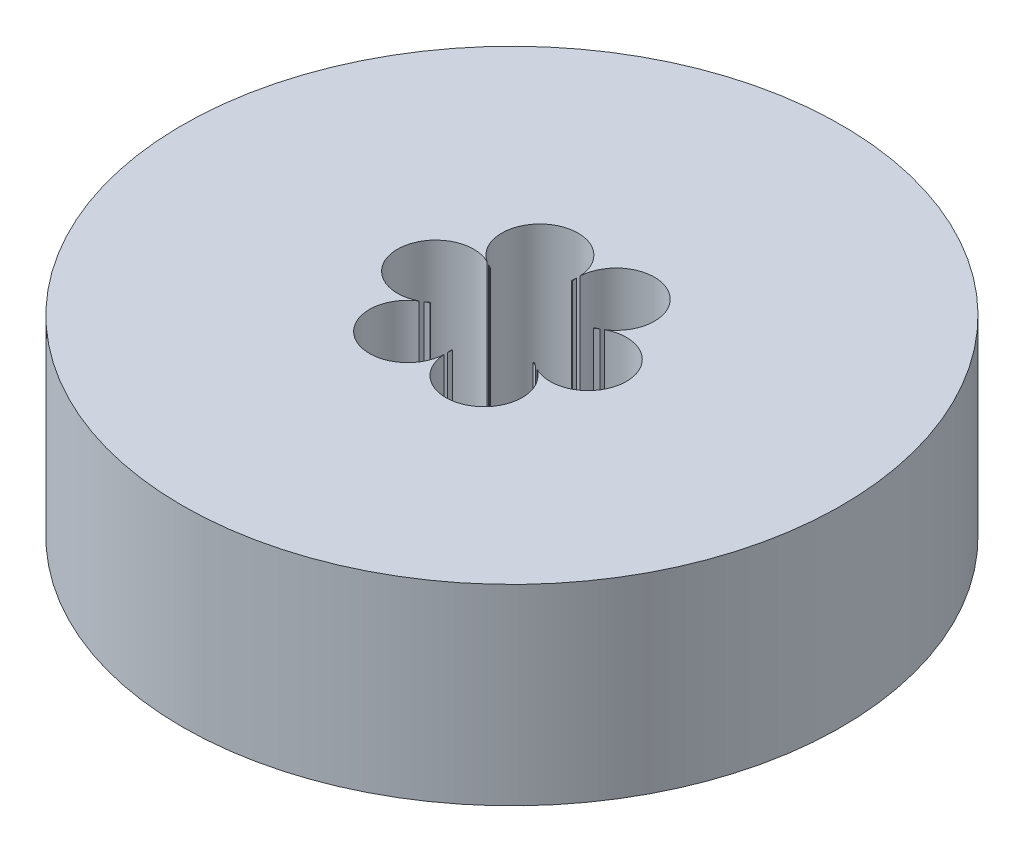
ISO-10303-21;
HEADER;
FILE_DESCRIPTION(('STEP AP214'),'2;1');
FILE_NAME('part.step','',(''),(''),'','','');
FILE_SCHEMA(('AUTOMOTIVE_DESIGN { 1 0 10303 214 1 1 1 1 }'));
ENDSEC;
DATA;
#1=APPLICATION_CONTEXT('core data for automotive mechanical design processes');
#2=APPLICATION_PROTOCOL_DEFINITION('international standard','automotive_design',2000,#1);
#3=PRODUCT_CONTEXT('',#1,'mechanical');
#4=PRODUCT('Part','Part','',(#3));
#5=PRODUCT_RELATED_PRODUCT_CATEGORY('part','',(#4));
#6=PRODUCT_DEFINITION_FORMATION('','',#4);
#7=PRODUCT_DEFINITION_CONTEXT('part definition',#1,'design');
#8=PRODUCT_DEFINITION('design','',#6,#7);
#9=PRODUCT_DEFINITION_SHAPE('','',#8);
#10=(LENGTH_UNIT() NAMED_UNIT(*) SI_UNIT(.MILLI.,.METRE.));
#11=(NAMED_UNIT(*) PLANE_ANGLE_UNIT() SI_UNIT($,.RADIAN.));
#12=(NAMED_UNIT(*) SI_UNIT($,.STERADIAN.) SOLID_ANGLE_UNIT());
#13=UNCERTAINTY_MEASURE_WITH_UNIT(LENGTH_MEASURE(1.E-05),#10,'distance_accuracy_value','');
#14=(GEOMETRIC_REPRESENTATION_CONTEXT(3) GLOBAL_UNCERTAINTY_ASSIGNED_CONTEXT((#13)) GLOBAL_UNIT_ASSIGNED_CONTEXT((#10,
#11,#12)) REPRESENTATION_CONTEXT('',''));
#15=CARTESIAN_POINT('',(0.,0.,0.));
#16=DIRECTION('',(0.,0.,1.));
#17=DIRECTION('',(1.,0.,0.));
#18=AXIS2_PLACEMENT_3D('',#15,#16,#17);
#19=CARTESIAN_POINT('',(0.,16.,0.));
#20=DIRECTION('',(0.,1.,0.));
#21=DIRECTION('',(0.,0.,1.));
#22=AXIS2_PLACEMENT_3D('',#19,#20,#21);
#23=PLANE('',#22);
#24=CARTESIAN_POINT('',(-3.18521548853427,16.,5.51695505919671));
#25=DIRECTION('',(0.,1.,0.));
#26=DIRECTION('',(0.86602540378444,0.,0.499999999999998));
#27=AXIS2_PLACEMENT_3D('',#24,#25,#26);
#28=CIRCLE('',#27,3.18857524727251);
#29=CARTESIAN_POINT('',(-4.31057112125339,16.,2.53356993363442));
#30=VERTEX_POINT('',#29);
#31=CARTESIAN_POINT('',(-4.65109202377948,16.,2.68530923195481));
#32=VERTEX_POINT('',#31);
#33=EDGE_CURVE('E298',#30,#32,#28,.T.);
#34=ORIENTED_EDGE('',*,*,#33,.F.);
#35=CARTESIAN_POINT('',(0.,16.,0.));
#36=DIRECTION('',(0.,1.,0.));
#37=DIRECTION('',(0.,0.,1.));
#38=AXIS2_PLACEMENT_3D('',#35,#36,#37);
#39=CIRCLE('',#38,5.);
#40=CARTESIAN_POINT('',(-4.34942148541855,16.,2.4662791290078));
#41=VERTEX_POINT('',#40);
#42=EDGE_CURVE('E329',#41,#30,#39,.T.);
#43=ORIENTED_EDGE('',*,*,#42,.F.);
#44=CARTESIAN_POINT('',(-6.37043097706857,16.,0.));
#45=DIRECTION('',(0.,1.,0.));
#46=DIRECTION('',(0.,0.,1.));
#47=AXIS2_PLACEMENT_3D('',#44,#45,#46);
#48=CIRCLE('',#47,3.18857524727251);
#49=EDGE_CURVE('E328',#32,#41,#48,.T.);
#50=ORIENTED_EDGE('',*,*,#49,.F.);
#51=EDGE_LOOP('',(#34,#43,#50));
#52=FACE_BOUND('',#51,.T.);
#53=ADVANCED_FACE('F39',(#52),#23,.T.);
#54=CARTESIAN_POINT('',(-3.18521548853435,16.,-5.51695505919666));
#55=DIRECTION('',(0.,1.,0.));
#56=DIRECTION('',(-0.866025403784433,0.,0.50000000000001));
#57=AXIS2_PLACEMENT_3D('',#54,#55,#56);
#58=CIRCLE('',#57,3.18857524727251);
#59=CARTESIAN_POINT('',(-4.65109202377879,16.,-2.68530923195437));
#60=VERTEX_POINT('',#59);
#61=CARTESIAN_POINT('',(-4.31057112125342,16.,-2.53356993363436));
#62=VERTEX_POINT('',#61);
#63=EDGE_CURVE('E233',#60,#62,#58,.T.);
#64=ORIENTED_EDGE('',*,*,#63,.F.);
#65=CARTESIAN_POINT('',(-4.34942148541855,16.,-2.4662791290078));
#66=VERTEX_POINT('',#65);
#67=EDGE_CURVE('E324',#66,#60,#48,.T.);
#68=ORIENTED_EDGE('',*,*,#67,.F.);
#69=EDGE_CURVE('E333',#62,#66,#39,.T.);
#70=ORIENTED_EDGE('',*,*,#69,.F.);
#71=EDGE_LOOP('',(#64,#68,#70));
#72=FACE_BOUND('',#71,.T.);
#73=ADVANCED_FACE('F439',(#72),#23,.T.);
#74=CARTESIAN_POINT('',(3.18521548853423,16.,-5.51695505919673));
#75=DIRECTION('',(0.,1.,0.));
#76=DIRECTION('',(-0.866025403784443,0.,-0.499999999999992));
#77=AXIS2_PLACEMENT_3D('',#74,#75,#76);
#78=CIRCLE('',#77,3.18857524727251);
#79=CARTESIAN_POINT('',(4.31057112125337,16.,-2.53356993363445));
#80=VERTEX_POINT('',#79);
#81=CARTESIAN_POINT('',(4.65109202377982,16.,-2.68530923195503));
#82=VERTEX_POINT('',#81);
#83=EDGE_CURVE('E251',#80,#82,#78,.T.);
#84=ORIENTED_EDGE('',*,*,#83,.F.);
#85=CARTESIAN_POINT('',(4.34942148541855,16.,-2.4662791290078));
#86=VERTEX_POINT('',#85);
#87=EDGE_CURVE('E392',#86,#80,#39,.T.);
#88=ORIENTED_EDGE('',*,*,#87,.F.);
#89=CARTESIAN_POINT('',(6.37043097706857,16.,0.));
#90=DIRECTION('',(0.,1.,0.));
#91=DIRECTION('',(0.,0.,-1.));
#92=AXIS2_PLACEMENT_3D('',#89,#90,#91);
#93=CIRCLE('',#92,3.18857524727251);
#94=EDGE_CURVE('E263',#82,#86,#93,.T.);
#95=ORIENTED_EDGE('',*,*,#94,.F.);
#96=EDGE_LOOP('',(#84,#88,#95));
#97=FACE_BOUND('',#96,.T.);
#98=ADVANCED_FACE('F450',(#97),#23,.T.);
#99=CARTESIAN_POINT('',(4.34942148541855,16.,2.4662791290078));
#100=VERTEX_POINT('',#99);
#101=CARTESIAN_POINT('',(4.65109202377915,16.,2.6853092319546));
#102=VERTEX_POINT('',#101);
#103=EDGE_CURVE('E262',#100,#102,#93,.T.);
#104=ORIENTED_EDGE('',*,*,#103,.F.);
#105=CARTESIAN_POINT('',(4.3105711212534,16.,2.53356993363439));
#106=VERTEX_POINT('',#105);
#107=EDGE_CURVE('E394',#106,#100,#39,.T.);
#108=ORIENTED_EDGE('',*,*,#107,.F.);
#109=CARTESIAN_POINT('',(3.18521548853431,16.,5.51695505919669));
#110=DIRECTION('',(0.,1.,0.));
#111=DIRECTION('',(0.866025403784436,0.,-0.500000000000004));
#112=AXIS2_PLACEMENT_3D('',#109,#110,#111);
#113=CIRCLE('',#112,3.18857524727251);
#114=EDGE_CURVE('E280',#102,#106,#113,.T.);
#115=ORIENTED_EDGE('',*,*,#114,.F.);
#116=EDGE_LOOP('',(#104,#108,#115));
#117=FACE_BOUND('',#116,.T.);
#118=ADVANCED_FACE('F470',(#117),#23,.T.);
#119=CARTESIAN_POINT('',(0.0388503641651819,16.,4.99984906264222));
#120=VERTEX_POINT('',#119);
#121=CARTESIAN_POINT('',(0.,16.,5.37061846390962));
#122=VERTEX_POINT('',#121);
#123=EDGE_CURVE('E276',#120,#122,#113,.T.);
#124=ORIENTED_EDGE('',*,*,#123,.F.);
#125=CARTESIAN_POINT('',(-0.0388503641651468,16.,4.99984906264222));
#126=VERTEX_POINT('',#125);
#127=EDGE_CURVE('E331',#126,#120,#39,.T.);
#128=ORIENTED_EDGE('',*,*,#127,.F.);
#129=EDGE_CURVE('E300',#122,#126,#28,.T.);
#130=ORIENTED_EDGE('',*,*,#129,.F.);
#131=EDGE_LOOP('',(#124,#128,#130));
#132=FACE_BOUND('',#131,.T.);
#133=ADVANCED_FACE('F405',(#132),#23,.T.);
#134=CARTESIAN_POINT('',(0.,16.,-5.37061846390962));
#135=VERTEX_POINT('',#134);
#136=CARTESIAN_POINT('',(0.0388503641651117,16.,-4.99984906264222));
#137=VERTEX_POINT('',#136);
#138=EDGE_CURVE('E215',#135,#137,#78,.T.);
#139=ORIENTED_EDGE('',*,*,#138,.F.);
#140=CARTESIAN_POINT('',(-0.0388503641652158,16.,-4.99984906264222));
#141=VERTEX_POINT('',#140);
#142=EDGE_CURVE('E234',#141,#135,#58,.T.);
#143=ORIENTED_EDGE('',*,*,#142,.F.);
#144=EDGE_CURVE('E252',#137,#141,#39,.T.);
#145=ORIENTED_EDGE('',*,*,#144,.F.);
#146=EDGE_LOOP('',(#139,#143,#145));
#147=FACE_BOUND('',#146,.T.);
#148=ADVANCED_FACE('F253',(#147),#23,.T.);
#149=CARTESIAN_POINT('',(-6.37043097706857,0.724362100448394,0.));
#150=DIRECTION('',(0.,1.,0.));
#151=DIRECTION('',(0.,0.,1.));
#152=AXIS2_PLACEMENT_3D('',#149,#150,#151);
#153=CYLINDRICAL_SURFACE('',#152,3.18857524727251);
#154=CARTESIAN_POINT('',(-6.37043097706857,0.724362100448394,0.));
#155=DIRECTION('',(0.,1.,0.));
#156=DIRECTION('',(0.,0.,1.));
#157=AXIS2_PLACEMENT_3D('',#154,#155,#156);
#158=CIRCLE('',#157,3.18857524727251);
#159=CARTESIAN_POINT('',(-4.65109202377948,0.724362100448394,2.68530923195481));
#160=VERTEX_POINT('',#159);
#161=CARTESIAN_POINT('',(-4.34942148541855,0.724362100448394,2.4662791290078));
#162=VERTEX_POINT('',#161);
#163=EDGE_CURVE('E65',#160,#162,#158,.T.);
#164=ORIENTED_EDGE('',*,*,#163,.F.);
#165=DIRECTION('',(0.,1.,0.));
#166=VECTOR('',#165,1.);
#167=CARTESIAN_POINT('',(-4.65109202377948,8.3621810502242,2.68530923195481));
#168=LINE('',#167,#166);
#169=EDGE_CURVE('E306',#160,#32,#168,.T.);
#170=ORIENTED_EDGE('',*,*,#169,.T.);
#171=ORIENTED_EDGE('',*,*,#49,.T.);
#172=DIRECTION('',(0.,1.,0.));
#173=VECTOR('',#172,1.);
#174=CARTESIAN_POINT('',(-4.34942148541855,8.3621810502242,2.4662791290078));
#175=LINE('',#174,#173);
#176=EDGE_CURVE('E347',#41,#162,#175,.F.);
#177=ORIENTED_EDGE('',*,*,#176,.T.);
#178=EDGE_LOOP('',(#164,#170,#171,#177));
#179=FACE_BOUND('',#178,.T.);
#180=ADVANCED_FACE('F458',(#179),#153,.F.);
#181=CARTESIAN_POINT('',(-4.90455444182412,16.,-2.83164582724229));
#182=VERTEX_POINT('',#181);
#183=CARTESIAN_POINT('',(-4.90455444182336,16.,2.8316458272419));
#184=VERTEX_POINT('',#183);
#185=EDGE_CURVE('E327',#182,#184,#48,.T.);
#186=ORIENTED_EDGE('',*,*,#185,.T.);
#187=DIRECTION('',(0.,1.,0.));
#188=VECTOR('',#187,1.);
#189=CARTESIAN_POINT('',(-4.90455444182336,8.3621810502242,2.8316458272419));
#190=LINE('',#189,#188);
#191=CARTESIAN_POINT('',(-4.90455444182336,0.724362100448394,2.8316458272419));
#192=VERTEX_POINT('',#191);
#193=EDGE_CURVE('E304',#184,#192,#190,.F.);
#194=ORIENTED_EDGE('',*,*,#193,.T.);
#195=CARTESIAN_POINT('',(-4.90455444182412,0.724362100448394,-2.83164582724229));
#196=VERTEX_POINT('',#195);
#197=EDGE_CURVE('E322',#196,#192,#158,.T.);
#198=ORIENTED_EDGE('',*,*,#197,.F.);
#199=DIRECTION('',(0.,1.,0.));
#200=VECTOR('',#199,1.);
#201=CARTESIAN_POINT('',(-4.90455444182412,8.3621810502242,-2.83164582724229));
#202=LINE('',#201,#200);
#203=EDGE_CURVE('E226',#196,#182,#202,.T.);
#204=ORIENTED_EDGE('',*,*,#203,.T.);
#205=EDGE_LOOP('',(#186,#194,#198,#204));
#206=FACE_BOUND('',#205,.T.);
#207=ADVANCED_FACE('F423',(#206),#153,.F.);
#208=CARTESIAN_POINT('',(0.,16.,0.));
#209=DIRECTION('',(0.,-1.,0.));
#210=DIRECTION('',(0.,0.,-1.));
#211=AXIS2_PLACEMENT_3D('',#208,#209,#210);
#212=CYLINDRICAL_SURFACE('',#211,27.5);
#213=CARTESIAN_POINT('',(0.,16.,0.));
#214=DIRECTION('',(0.,1.,0.));
#215=DIRECTION('',(0.,0.,1.));
#216=AXIS2_PLACEMENT_3D('',#213,#214,#215);
#217=CIRCLE('',#216,27.5);
#218=CARTESIAN_POINT('',(0.,16.,27.5));
#219=VERTEX_POINT('',#218);
#220=EDGE_CURVE('E337',#219,#219,#217,.T.);
#221=ORIENTED_EDGE('',*,*,#220,.F.);
#222=EDGE_LOOP('',(#221));
#223=FACE_BOUND('',#222,.T.);
#224=CARTESIAN_POINT('',(0.,0.,0.));
#225=DIRECTION('',(0.,1.,0.));
#226=DIRECTION('',(0.,0.,1.));
#227=AXIS2_PLACEMENT_3D('',#224,#225,#226);
#228=CIRCLE('',#227,27.5);
#229=CARTESIAN_POINT('',(0.,0.,27.5));
#230=VERTEX_POINT('',#229);
#231=EDGE_CURVE('E334',#230,#230,#228,.T.);
#232=ORIENTED_EDGE('',*,*,#231,.T.);
#233=EDGE_LOOP('',(#232));
#234=FACE_BOUND('',#233,.T.);
#235=ADVANCED_FACE('F41',(#223,#234),#212,.T.);
#236=CARTESIAN_POINT('',(0.,16.,5.66329165448378));
#237=VERTEX_POINT('',#236);
#238=EDGE_CURVE('E289',#184,#237,#28,.T.);
#239=ORIENTED_EDGE('',*,*,#238,.F.);
#240=ORIENTED_EDGE('',*,*,#185,.F.);
#241=CARTESIAN_POINT('',(0.,16.,-5.66329165448378));
#242=VERTEX_POINT('',#241);
#243=EDGE_CURVE('E229',#242,#182,#58,.T.);
#244=ORIENTED_EDGE('',*,*,#243,.F.);
#245=CARTESIAN_POINT('',(4.90455444182298,16.,-2.8316458272417));
#246=VERTEX_POINT('',#245);
#247=EDGE_CURVE('E218',#246,#242,#78,.T.);
#248=ORIENTED_EDGE('',*,*,#247,.F.);
#249=CARTESIAN_POINT('',(4.90455444182372,16.,2.83164582724209));
#250=VERTEX_POINT('',#249);
#251=EDGE_CURVE('E257',#250,#246,#93,.T.);
#252=ORIENTED_EDGE('',*,*,#251,.F.);
#253=EDGE_CURVE('E269',#237,#250,#113,.T.);
#254=ORIENTED_EDGE('',*,*,#253,.F.);
#255=EDGE_LOOP('',(#239,#240,#244,#248,#252,#254));
#256=FACE_BOUND('',#255,.T.);
#257=ORIENTED_EDGE('',*,*,#220,.T.);
#258=EDGE_LOOP('',(#257));
#259=FACE_BOUND('',#258,.T.);
#260=ADVANCED_FACE('F418',(#256,#259),#23,.T.);
#261=CARTESIAN_POINT('',(0.,0.,0.));
#262=DIRECTION('',(0.,1.,0.));
#263=DIRECTION('',(0.,0.,1.));
#264=AXIS2_PLACEMENT_3D('',#261,#262,#263);
#265=PLANE('',#264);
#266=CARTESIAN_POINT('',(0.,0.,0.));
#267=DIRECTION('',(0.,1.,0.));
#268=DIRECTION('',(0.,0.,1.));
#269=AXIS2_PLACEMENT_3D('',#266,#267,#268);
#270=CIRCLE('',#269,5.);
#271=CARTESIAN_POINT('',(0.,0.,5.));
#272=VERTEX_POINT('',#271);
#273=EDGE_CURVE('E323',#272,#272,#270,.T.);
#274=ORIENTED_EDGE('',*,*,#273,.T.);
#275=EDGE_LOOP('',(#274));
#276=FACE_BOUND('',#275,.T.);
#277=ORIENTED_EDGE('',*,*,#231,.F.);
#278=EDGE_LOOP('',(#277));
#279=FACE_BOUND('',#278,.T.);
#280=ADVANCED_FACE('F451',(#276,#279),#265,.F.);
#281=CARTESIAN_POINT('',(0.,16.,0.));
#282=DIRECTION('',(0.,-1.,0.));
#283=DIRECTION('',(0.,0.,-1.));
#284=AXIS2_PLACEMENT_3D('',#281,#282,#283);
#285=CYLINDRICAL_SURFACE('',#284,5.);
#286=DIRECTION('',(0.,1.,0.));
#287=VECTOR('',#286,1.);
#288=CARTESIAN_POINT('',(-4.31057112125339,8.3621810502242,2.53356993363442));
#289=LINE('',#288,#287);
#290=CARTESIAN_POINT('',(-4.31057112125339,0.724362100448394,2.53356993363442));
#291=VERTEX_POINT('',#290);
#292=EDGE_CURVE('E311',#291,#30,#289,.T.);
#293=ORIENTED_EDGE('',*,*,#292,.F.);
#294=CARTESIAN_POINT('',(0.,0.724362100448394,0.));
#295=DIRECTION('',(0.,1.,0.));
#296=DIRECTION('',(0.,0.,1.));
#297=AXIS2_PLACEMENT_3D('',#294,#295,#296);
#298=CIRCLE('',#297,5.);
#299=CARTESIAN_POINT('',(-0.0388503641651468,0.724362100448394,4.99984906264222));
#300=VERTEX_POINT('',#299);
#301=EDGE_CURVE('E312',#291,#300,#298,.T.);
#302=ORIENTED_EDGE('',*,*,#301,.T.);
#303=DIRECTION('',(0.,1.,0.));
#304=VECTOR('',#303,1.);
#305=CARTESIAN_POINT('',(-0.0388503641651464,8.3621810502242,4.99984906264222));
#306=LINE('',#305,#304);
#307=EDGE_CURVE('E313',#126,#300,#306,.F.);
#308=ORIENTED_EDGE('',*,*,#307,.F.);
#309=ORIENTED_EDGE('',*,*,#127,.T.);
#310=DIRECTION('',(0.,1.,0.));
#311=VECTOR('',#310,1.);
#312=CARTESIAN_POINT('',(0.0388503641651815,8.3621810502242,4.99984906264222));
#313=LINE('',#312,#311);
#314=CARTESIAN_POINT('',(0.0388503641651819,0.724362100448394,4.99984906264222));
#315=VERTEX_POINT('',#314);
#316=EDGE_CURVE('E11',#315,#120,#313,.T.);
#317=ORIENTED_EDGE('',*,*,#316,.F.);
#318=CARTESIAN_POINT('',(4.3105711212534,0.724362100448394,2.53356993363439));
#319=VERTEX_POINT('',#318);
#320=EDGE_CURVE('E317',#315,#319,#298,.T.);
#321=ORIENTED_EDGE('',*,*,#320,.T.);
#322=DIRECTION('',(0.,1.,0.));
#323=VECTOR('',#322,1.);
#324=CARTESIAN_POINT('',(4.3105711212534,8.3621810502242,2.53356993363439));
#325=LINE('',#324,#323);
#326=EDGE_CURVE('E50',#106,#319,#325,.F.);
#327=ORIENTED_EDGE('',*,*,#326,.F.);
#328=ORIENTED_EDGE('',*,*,#107,.T.);
#329=DIRECTION('',(0.,1.,0.));
#330=VECTOR('',#329,1.);
#331=CARTESIAN_POINT('',(4.34942148541855,8.3621810502242,2.4662791290078));
#332=LINE('',#331,#330);
#333=CARTESIAN_POINT('',(4.34942148541855,0.724362100448394,2.4662791290078));
#334=VERTEX_POINT('',#333);
#335=EDGE_CURVE('E360',#334,#100,#332,.T.);
#336=ORIENTED_EDGE('',*,*,#335,.F.);
#337=CARTESIAN_POINT('',(4.34942148541855,0.724362100448394,-2.4662791290078));
#338=VERTEX_POINT('',#337);
#339=EDGE_CURVE('E374',#334,#338,#298,.T.);
#340=ORIENTED_EDGE('',*,*,#339,.T.);
#341=DIRECTION('',(0.,1.,0.));
#342=VECTOR('',#341,1.);
#343=CARTESIAN_POINT('',(4.34942148541855,8.3621810502242,-2.4662791290078));
#344=LINE('',#343,#342);
#345=EDGE_CURVE('E354',#86,#338,#344,.F.);
#346=ORIENTED_EDGE('',*,*,#345,.F.);
#347=ORIENTED_EDGE('',*,*,#87,.T.);
#348=DIRECTION('',(0.,1.,0.));
#349=VECTOR('',#348,1.);
#350=CARTESIAN_POINT('',(4.31057112125337,8.3621810502242,-2.53356993363445));
#351=LINE('',#350,#349);
#352=CARTESIAN_POINT('',(4.31057112125337,0.724362100448394,-2.53356993363445));
#353=VERTEX_POINT('',#352);
#354=EDGE_CURVE('E352',#353,#80,#351,.T.);
#355=ORIENTED_EDGE('',*,*,#354,.F.);
#356=CARTESIAN_POINT('',(0.0388503641651117,0.724362100448394,-4.99984906264222));
#357=VERTEX_POINT('',#356);
#358=EDGE_CURVE('E380',#353,#357,#298,.T.);
#359=ORIENTED_EDGE('',*,*,#358,.T.);
#360=DIRECTION('',(0.,1.,0.));
#361=VECTOR('',#360,1.);
#362=CARTESIAN_POINT('',(0.0388503641651113,8.3621810502242,-4.99984906264222));
#363=LINE('',#362,#361);
#364=EDGE_CURVE('E351',#137,#357,#363,.F.);
#365=ORIENTED_EDGE('',*,*,#364,.F.);
#366=ORIENTED_EDGE('',*,*,#144,.T.);
#367=DIRECTION('',(0.,1.,0.));
#368=VECTOR('',#367,1.);
#369=CARTESIAN_POINT('',(-0.0388503641652162,8.3621810502242,-4.99984906264222));
#370=LINE('',#369,#368);
#371=CARTESIAN_POINT('',(-0.0388503641652158,0.724362100448394,-4.99984906264222));
#372=VERTEX_POINT('',#371);
#373=EDGE_CURVE('E245',#372,#141,#370,.T.);
#374=ORIENTED_EDGE('',*,*,#373,.F.);
#375=CARTESIAN_POINT('',(-4.31057112125342,0.724362100448394,-2.53356993363436));
#376=VERTEX_POINT('',#375);
#377=EDGE_CURVE('E318',#372,#376,#298,.T.);
#378=ORIENTED_EDGE('',*,*,#377,.T.);
#379=DIRECTION('',(0.,1.,0.));
#380=VECTOR('',#379,1.);
#381=CARTESIAN_POINT('',(-4.31057112125342,8.3621810502242,-2.53356993363436));
#382=LINE('',#381,#380);
#383=EDGE_CURVE('E305',#62,#376,#382,.F.);
#384=ORIENTED_EDGE('',*,*,#383,.F.);
#385=ORIENTED_EDGE('',*,*,#69,.T.);
#386=DIRECTION('',(0.,1.,0.));
#387=VECTOR('',#386,1.);
#388=CARTESIAN_POINT('',(-4.34942148541855,8.3621810502242,-2.4662791290078));
#389=LINE('',#388,#387);
#390=CARTESIAN_POINT('',(-4.34942148541855,0.724362100448394,-2.4662791290078));
#391=VERTEX_POINT('',#390);
#392=EDGE_CURVE('E346',#391,#66,#389,.T.);
#393=ORIENTED_EDGE('',*,*,#392,.F.);
#394=CARTESIAN_POINT('',(0.,0.724362100448394,0.));
#395=DIRECTION('',(0.,1.,0.));
#396=DIRECTION('',(0.,0.,1.));
#397=AXIS2_PLACEMENT_3D('',#394,#395,#396);
#398=CIRCLE('',#397,5.);
#399=EDGE_CURVE('E341',#391,#162,#398,.T.);
#400=ORIENTED_EDGE('',*,*,#399,.T.);
#401=ORIENTED_EDGE('',*,*,#176,.F.);
#402=ORIENTED_EDGE('',*,*,#42,.T.);
#403=EDGE_LOOP('',(#293,#302,#308,#309,#317,#321,#327,#328,#336,#340,#346,#347,#355,#359,#365,
#366,#374,#378,#384,#385,#393,#400,#401,#402));
#404=FACE_BOUND('',#403,.T.);
#405=ORIENTED_EDGE('',*,*,#273,.F.);
#406=EDGE_LOOP('',(#405));
#407=FACE_BOUND('',#406,.T.);
#408=ADVANCED_FACE('F375',(#404,#407),#285,.F.);
#409=ORIENTED_EDGE('',*,*,#67,.T.);
#410=DIRECTION('',(0.,1.,0.));
#411=VECTOR('',#410,1.);
#412=CARTESIAN_POINT('',(-4.6510920237788,8.3621810502242,-2.68530923195437));
#413=LINE('',#412,#411);
#414=CARTESIAN_POINT('',(-4.6510920237788,0.724362100448394,-2.68530923195437));
#415=VERTEX_POINT('',#414);
#416=EDGE_CURVE('E294',#60,#415,#413,.F.);
#417=ORIENTED_EDGE('',*,*,#416,.T.);
#418=EDGE_CURVE('E319',#391,#415,#158,.T.);
#419=ORIENTED_EDGE('',*,*,#418,.F.);
#420=ORIENTED_EDGE('',*,*,#392,.T.);
#421=EDGE_LOOP('',(#409,#417,#419,#420));
#422=FACE_BOUND('',#421,.T.);
#423=ADVANCED_FACE('F389',(#422),#153,.F.);
#424=CARTESIAN_POINT('',(-6.37043097706857,0.724362100448394,0.));
#425=DIRECTION('',(0.,1.,0.));
#426=DIRECTION('',(0.,0.,1.));
#427=AXIS2_PLACEMENT_3D('',#424,#425,#426);
#428=PLANE('',#427);
#429=CARTESIAN_POINT('',(-3.18521548853435,0.724362100448394,-5.51695505919666));
#430=DIRECTION('',(0.,1.,0.));
#431=DIRECTION('',(-0.866025403784433,0.,0.50000000000001));
#432=AXIS2_PLACEMENT_3D('',#429,#430,#431);
#433=CIRCLE('',#432,3.18857524727251);
#434=CARTESIAN_POINT('',(0.,0.724362100448394,-5.66329165448378));
#435=VERTEX_POINT('',#434);
#436=EDGE_CURVE('E202',#435,#196,#433,.T.);
#437=ORIENTED_EDGE('',*,*,#436,.T.);
#438=ORIENTED_EDGE('',*,*,#197,.T.);
#439=CARTESIAN_POINT('',(-3.18521548853427,0.724362100448394,5.51695505919671));
#440=DIRECTION('',(0.,1.,0.));
#441=DIRECTION('',(0.86602540378444,0.,0.499999999999998));
#442=AXIS2_PLACEMENT_3D('',#439,#440,#441);
#443=CIRCLE('',#442,3.18857524727251);
#444=CARTESIAN_POINT('',(0.,0.724362100448394,5.66329165448378));
#445=VERTEX_POINT('',#444);
#446=EDGE_CURVE('E296',#192,#445,#443,.T.);
#447=ORIENTED_EDGE('',*,*,#446,.T.);
#448=CARTESIAN_POINT('',(3.18521548853431,0.724362100448394,5.51695505919669));
#449=DIRECTION('',(0.,1.,0.));
#450=DIRECTION('',(0.866025403784436,0.,-0.500000000000004));
#451=AXIS2_PLACEMENT_3D('',#448,#449,#450);
#452=CIRCLE('',#451,3.18857524727251);
#453=CARTESIAN_POINT('',(4.90455444182372,0.724362100448394,2.83164582724209));
#454=VERTEX_POINT('',#453);
#455=EDGE_CURVE('E277',#445,#454,#452,.T.);
#456=ORIENTED_EDGE('',*,*,#455,.T.);
#457=CARTESIAN_POINT('',(6.37043097706857,0.724362100448394,0.));
#458=DIRECTION('',(0.,1.,0.));
#459=DIRECTION('',(0.,0.,-1.));
#460=AXIS2_PLACEMENT_3D('',#457,#458,#459);
#461=CIRCLE('',#460,3.18857524727251);
#462=CARTESIAN_POINT('',(4.90455444182298,0.724362100448394,-2.8316458272417));
#463=VERTEX_POINT('',#462);
#464=EDGE_CURVE('E208',#454,#463,#461,.T.);
#465=ORIENTED_EDGE('',*,*,#464,.T.);
#466=CARTESIAN_POINT('',(3.18521548853423,0.724362100448394,-5.51695505919673));
#467=DIRECTION('',(0.,1.,0.));
#468=DIRECTION('',(-0.866025403784443,0.,-0.499999999999992));
#469=AXIS2_PLACEMENT_3D('',#466,#467,#468);
#470=CIRCLE('',#469,3.18857524727251);
#471=EDGE_CURVE('E199',#463,#435,#470,.T.);
#472=ORIENTED_EDGE('',*,*,#471,.T.);
#473=EDGE_LOOP('',(#437,#438,#447,#456,#465,#472));
#474=FACE_BOUND('',#473,.T.);
#475=ORIENTED_EDGE('',*,*,#418,.T.);
#476=EDGE_CURVE('E53',#415,#376,#433,.T.);
#477=ORIENTED_EDGE('',*,*,#476,.T.);
#478=ORIENTED_EDGE('',*,*,#377,.F.);
#479=CARTESIAN_POINT('',(0.,0.724362100448394,-5.37061846390962));
#480=VERTEX_POINT('',#479);
#481=EDGE_CURVE('E227',#372,#480,#433,.T.);
#482=ORIENTED_EDGE('',*,*,#481,.T.);
#483=EDGE_CURVE('E212',#480,#357,#470,.T.);
#484=ORIENTED_EDGE('',*,*,#483,.T.);
#485=ORIENTED_EDGE('',*,*,#358,.F.);
#486=CARTESIAN_POINT('',(4.65109202377982,0.724362100448394,-2.68530923195503));
#487=VERTEX_POINT('',#486);
#488=EDGE_CURVE('E211',#353,#487,#470,.T.);
#489=ORIENTED_EDGE('',*,*,#488,.T.);
#490=EDGE_CURVE('E256',#487,#338,#461,.T.);
#491=ORIENTED_EDGE('',*,*,#490,.T.);
#492=ORIENTED_EDGE('',*,*,#339,.F.);
#493=CARTESIAN_POINT('',(4.65109202377915,0.724362100448394,2.6853092319546));
#494=VERTEX_POINT('',#493);
#495=EDGE_CURVE('E259',#334,#494,#461,.T.);
#496=ORIENTED_EDGE('',*,*,#495,.T.);
#497=EDGE_CURVE('E271',#494,#319,#452,.T.);
#498=ORIENTED_EDGE('',*,*,#497,.T.);
#499=ORIENTED_EDGE('',*,*,#320,.F.);
#500=CARTESIAN_POINT('',(0.,0.724362100448394,5.37061846390962));
#501=VERTEX_POINT('',#500);
#502=EDGE_CURVE('E274',#315,#501,#452,.T.);
#503=ORIENTED_EDGE('',*,*,#502,.T.);
#504=EDGE_CURVE('E292',#501,#300,#443,.T.);
#505=ORIENTED_EDGE('',*,*,#504,.T.);
#506=ORIENTED_EDGE('',*,*,#301,.F.);
#507=EDGE_CURVE('E293',#291,#160,#443,.T.);
#508=ORIENTED_EDGE('',*,*,#507,.T.);
#509=ORIENTED_EDGE('',*,*,#163,.T.);
#510=ORIENTED_EDGE('',*,*,#399,.F.);
#511=EDGE_LOOP('',(#475,#477,#478,#482,#484,#485,#489,#491,#492,#496,#498,#499,#503,#505,#506,
#508,#509,#510));
#512=FACE_BOUND('',#511,.T.);
#513=ADVANCED_FACE('F205',(#474,#512),#428,.T.);
#514=CARTESIAN_POINT('',(3.18521548853431,0.724362100448394,5.51695505919669));
#515=DIRECTION('',(0.,1.,0.));
#516=DIRECTION('',(0.,0.,1.));
#517=AXIS2_PLACEMENT_3D('',#514,#515,#516);
#518=CYLINDRICAL_SURFACE('',#517,3.18857524727251);
#519=ORIENTED_EDGE('',*,*,#316,.T.);
#520=ORIENTED_EDGE('',*,*,#123,.T.);
#521=DIRECTION('',(0.,1.,0.));
#522=VECTOR('',#521,1.);
#523=CARTESIAN_POINT('',(0.,8.3621810502242,5.37061846390962));
#524=LINE('',#523,#522);
#525=EDGE_CURVE('E290',#501,#122,#524,.T.);
#526=ORIENTED_EDGE('',*,*,#525,.F.);
#527=ORIENTED_EDGE('',*,*,#502,.F.);
#528=EDGE_LOOP('',(#519,#520,#526,#527));
#529=FACE_BOUND('',#528,.T.);
#530=ADVANCED_FACE('F422',(#529),#518,.F.);
#531=CARTESIAN_POINT('',(6.37043097706857,0.724362100448394,0.));
#532=DIRECTION('',(0.,1.,0.));
#533=DIRECTION('',(0.,0.,1.));
#534=AXIS2_PLACEMENT_3D('',#531,#532,#533);
#535=CYLINDRICAL_SURFACE('',#534,3.18857524727251);
#536=ORIENTED_EDGE('',*,*,#335,.T.);
#537=ORIENTED_EDGE('',*,*,#103,.T.);
#538=DIRECTION('',(0.,1.,0.));
#539=VECTOR('',#538,1.);
#540=CARTESIAN_POINT('',(4.65109202377915,8.3621810502242,2.6853092319546));
#541=LINE('',#540,#539);
#542=EDGE_CURVE('E270',#494,#102,#541,.T.);
#543=ORIENTED_EDGE('',*,*,#542,.F.);
#544=ORIENTED_EDGE('',*,*,#495,.F.);
#545=EDGE_LOOP('',(#536,#537,#543,#544));
#546=FACE_BOUND('',#545,.T.);
#547=ADVANCED_FACE('F487',(#546),#535,.F.);
#548=CARTESIAN_POINT('',(3.18521548853423,0.724362100448394,-5.51695505919673));
#549=DIRECTION('',(0.,1.,0.));
#550=DIRECTION('',(0.,0.,1.));
#551=AXIS2_PLACEMENT_3D('',#548,#549,#550);
#552=CYLINDRICAL_SURFACE('',#551,3.18857524727251);
#553=ORIENTED_EDGE('',*,*,#354,.T.);
#554=ORIENTED_EDGE('',*,*,#83,.T.);
#555=DIRECTION('',(0.,1.,0.));
#556=VECTOR('',#555,1.);
#557=CARTESIAN_POINT('',(4.65109202377982,8.3621810502242,-2.68530923195503));
#558=LINE('',#557,#556);
#559=EDGE_CURVE('E281',#487,#82,#558,.T.);
#560=ORIENTED_EDGE('',*,*,#559,.F.);
#561=ORIENTED_EDGE('',*,*,#488,.F.);
#562=EDGE_LOOP('',(#553,#554,#560,#561));
#563=FACE_BOUND('',#562,.T.);
#564=ADVANCED_FACE('F434',(#563),#552,.F.);
#565=CARTESIAN_POINT('',(-3.18521548853427,0.724362100448394,5.51695505919671));
#566=DIRECTION('',(0.,1.,0.));
#567=DIRECTION('',(0.,0.,1.));
#568=AXIS2_PLACEMENT_3D('',#565,#566,#567);
#569=CYLINDRICAL_SURFACE('',#568,3.18857524727251);
#570=ORIENTED_EDGE('',*,*,#292,.T.);
#571=ORIENTED_EDGE('',*,*,#33,.T.);
#572=ORIENTED_EDGE('',*,*,#169,.F.);
#573=ORIENTED_EDGE('',*,*,#507,.F.);
#574=EDGE_LOOP('',(#570,#571,#572,#573));
#575=FACE_BOUND('',#574,.T.);
#576=ADVANCED_FACE('F427',(#575),#569,.F.);
#577=ORIENTED_EDGE('',*,*,#307,.T.);
#578=ORIENTED_EDGE('',*,*,#504,.F.);
#579=ORIENTED_EDGE('',*,*,#525,.T.);
#580=ORIENTED_EDGE('',*,*,#129,.T.);
#581=EDGE_LOOP('',(#577,#578,#579,#580));
#582=FACE_BOUND('',#581,.T.);
#583=ADVANCED_FACE('F430',(#582),#569,.F.);
#584=ORIENTED_EDGE('',*,*,#238,.T.);
#585=DIRECTION('',(0.,1.,0.));
#586=VECTOR('',#585,1.);
#587=CARTESIAN_POINT('',(0.,8.3621810502242,5.66329165448378));
#588=LINE('',#587,#586);
#589=EDGE_CURVE('E283',#237,#445,#588,.F.);
#590=ORIENTED_EDGE('',*,*,#589,.T.);
#591=ORIENTED_EDGE('',*,*,#446,.F.);
#592=ORIENTED_EDGE('',*,*,#193,.F.);
#593=EDGE_LOOP('',(#584,#590,#591,#592));
#594=FACE_BOUND('',#593,.T.);
#595=ADVANCED_FACE('F421',(#594),#569,.F.);
#596=CARTESIAN_POINT('',(-3.18521548853435,0.724362100448394,-5.51695505919666));
#597=DIRECTION('',(0.,1.,0.));
#598=DIRECTION('',(0.,0.,1.));
#599=AXIS2_PLACEMENT_3D('',#596,#597,#598);
#600=CYLINDRICAL_SURFACE('',#599,3.18857524727251);
#601=ORIENTED_EDGE('',*,*,#373,.T.);
#602=ORIENTED_EDGE('',*,*,#142,.T.);
#603=DIRECTION('',(0.,1.,0.));
#604=VECTOR('',#603,1.);
#605=CARTESIAN_POINT('',(0.,8.3621810502242,-5.37061846390962));
#606=LINE('',#605,#604);
#607=EDGE_CURVE('E225',#480,#135,#606,.T.);
#608=ORIENTED_EDGE('',*,*,#607,.F.);
#609=ORIENTED_EDGE('',*,*,#481,.F.);
#610=EDGE_LOOP('',(#601,#602,#608,#609));
#611=FACE_BOUND('',#610,.T.);
#612=ADVANCED_FACE('F239',(#611),#600,.F.);
#613=ORIENTED_EDGE('',*,*,#436,.F.);
#614=DIRECTION('',(0.,1.,0.));
#615=VECTOR('',#614,1.);
#616=CARTESIAN_POINT('',(0.,8.3621810502242,-5.66329165448378));
#617=LINE('',#616,#615);
#618=EDGE_CURVE('E216',#242,#435,#617,.F.);
#619=ORIENTED_EDGE('',*,*,#618,.F.);
#620=ORIENTED_EDGE('',*,*,#243,.T.);
#621=ORIENTED_EDGE('',*,*,#203,.F.);
#622=EDGE_LOOP('',(#613,#619,#620,#621));
#623=FACE_BOUND('',#622,.T.);
#624=ADVANCED_FACE('F221',(#623),#600,.F.);
#625=ORIENTED_EDGE('',*,*,#383,.T.);
#626=ORIENTED_EDGE('',*,*,#476,.F.);
#627=ORIENTED_EDGE('',*,*,#416,.F.);
#628=ORIENTED_EDGE('',*,*,#63,.T.);
#629=EDGE_LOOP('',(#625,#626,#627,#628));
#630=FACE_BOUND('',#629,.T.);
#631=ADVANCED_FACE('F493',(#630),#600,.F.);
#632=ORIENTED_EDGE('',*,*,#326,.T.);
#633=ORIENTED_EDGE('',*,*,#497,.F.);
#634=ORIENTED_EDGE('',*,*,#542,.T.);
#635=ORIENTED_EDGE('',*,*,#114,.T.);
#636=EDGE_LOOP('',(#632,#633,#634,#635));
#637=FACE_BOUND('',#636,.T.);
#638=ADVANCED_FACE('F363',(#637),#518,.F.);
#639=ORIENTED_EDGE('',*,*,#345,.T.);
#640=ORIENTED_EDGE('',*,*,#490,.F.);
#641=ORIENTED_EDGE('',*,*,#559,.T.);
#642=ORIENTED_EDGE('',*,*,#94,.T.);
#643=EDGE_LOOP('',(#639,#640,#641,#642));
#644=FACE_BOUND('',#643,.T.);
#645=ADVANCED_FACE('F486',(#644),#535,.F.);
#646=ORIENTED_EDGE('',*,*,#253,.T.);
#647=DIRECTION('',(0.,1.,0.));
#648=VECTOR('',#647,1.);
#649=CARTESIAN_POINT('',(4.90455444182372,8.3621810502242,2.83164582724209));
#650=LINE('',#649,#648);
#651=EDGE_CURVE('E260',#250,#454,#650,.F.);
#652=ORIENTED_EDGE('',*,*,#651,.T.);
#653=ORIENTED_EDGE('',*,*,#455,.F.);
#654=ORIENTED_EDGE('',*,*,#589,.F.);
#655=EDGE_LOOP('',(#646,#652,#653,#654));
#656=FACE_BOUND('',#655,.T.);
#657=ADVANCED_FACE('F408',(#656),#518,.F.);
#658=DIRECTION('',(0.,1.,0.));
#659=VECTOR('',#658,1.);
#660=CARTESIAN_POINT('',(4.90455444182298,8.3621810502242,-2.8316458272417));
#661=LINE('',#660,#659);
#662=EDGE_CURVE('E273',#246,#463,#661,.F.);
#663=ORIENTED_EDGE('',*,*,#662,.T.);
#664=ORIENTED_EDGE('',*,*,#464,.F.);
#665=ORIENTED_EDGE('',*,*,#651,.F.);
#666=ORIENTED_EDGE('',*,*,#251,.T.);
#667=EDGE_LOOP('',(#663,#664,#665,#666));
#668=FACE_BOUND('',#667,.T.);
#669=ADVANCED_FACE('F414',(#668),#535,.F.);
#670=ORIENTED_EDGE('',*,*,#364,.T.);
#671=ORIENTED_EDGE('',*,*,#483,.F.);
#672=ORIENTED_EDGE('',*,*,#607,.T.);
#673=ORIENTED_EDGE('',*,*,#138,.T.);
#674=EDGE_LOOP('',(#670,#671,#672,#673));
#675=FACE_BOUND('',#674,.T.);
#676=ADVANCED_FACE('F247',(#675),#552,.F.);
#677=ORIENTED_EDGE('',*,*,#247,.T.);
#678=ORIENTED_EDGE('',*,*,#618,.T.);
#679=ORIENTED_EDGE('',*,*,#471,.F.);
#680=ORIENTED_EDGE('',*,*,#662,.F.);
#681=EDGE_LOOP('',(#677,#678,#679,#680));
#682=FACE_BOUND('',#681,.T.);
#683=ADVANCED_FACE('F220',(#682),#552,.F.);
#684=CLOSED_SHELL('',(#53,#73,#98,#118,#133,#148,#180,#207,#235,#260,#280,#408,#423,#513,#530,
#547,#564,#576,#583,#595,#612,#624,#631,#638,#645,#657,#669,#676,#683));
#685=MANIFOLD_SOLID_BREP('B2',#684);
#686=ADVANCED_BREP_SHAPE_REPRESENTATION('',(#18,#685),#14);
#687=SHAPE_DEFINITION_REPRESENTATION(#9,#686);
ENDSEC;
END-ISO-10303-21;
